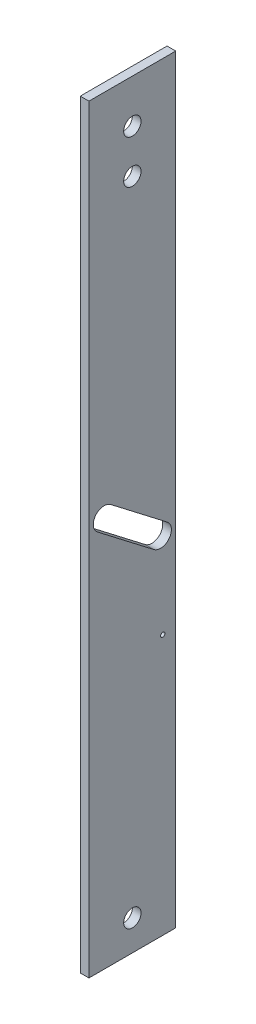
ISO-10303-21;
HEADER;
FILE_DESCRIPTION(('STEP AP214'),'2;1');
FILE_NAME('part.step','',(''),(''),'','','');
FILE_SCHEMA(('AUTOMOTIVE_DESIGN { 1 0 10303 214 1 1 1 1 }'));
ENDSEC;
DATA;
#1=APPLICATION_CONTEXT('core data for automotive mechanical design processes');
#2=APPLICATION_PROTOCOL_DEFINITION('international standard','automotive_design',2000,#1);
#3=PRODUCT_CONTEXT('',#1,'mechanical');
#4=PRODUCT('Part','Part','',(#3));
#5=PRODUCT_RELATED_PRODUCT_CATEGORY('part','',(#4));
#6=PRODUCT_DEFINITION_FORMATION('','',#4);
#7=PRODUCT_DEFINITION_CONTEXT('part definition',#1,'design');
#8=PRODUCT_DEFINITION('design','',#6,#7);
#9=PRODUCT_DEFINITION_SHAPE('','',#8);
#10=(LENGTH_UNIT() NAMED_UNIT(*) SI_UNIT(.MILLI.,.METRE.));
#11=(NAMED_UNIT(*) PLANE_ANGLE_UNIT() SI_UNIT($,.RADIAN.));
#12=(NAMED_UNIT(*) SI_UNIT($,.STERADIAN.) SOLID_ANGLE_UNIT());
#13=UNCERTAINTY_MEASURE_WITH_UNIT(LENGTH_MEASURE(1.E-05),#10,'distance_accuracy_value','');
#14=(GEOMETRIC_REPRESENTATION_CONTEXT(3) GLOBAL_UNCERTAINTY_ASSIGNED_CONTEXT((#13)) GLOBAL_UNIT_ASSIGNED_CONTEXT((#10,
#11,#12)) REPRESENTATION_CONTEXT('',''));
#15=CARTESIAN_POINT('',(0.,0.,0.));
#16=DIRECTION('',(0.,0.,1.));
#17=DIRECTION('',(1.,0.,0.));
#18=AXIS2_PLACEMENT_3D('',#15,#16,#17);
#19=CARTESIAN_POINT('',(2.,0.,0.));
#20=DIRECTION('',(0.,0.,-1.));
#21=DIRECTION('',(-1.,0.,0.));
#22=AXIS2_PLACEMENT_3D('',#19,#20,#21);
#23=PLANE('',#22);
#24=DIRECTION('',(0.,-1.,0.));
#25=VECTOR('',#24,1.);
#26=CARTESIAN_POINT('',(0.,0.,0.));
#27=LINE('',#26,#25);
#28=CARTESIAN_POINT('',(0.,175.,0.));
#29=VERTEX_POINT('',#28);
#30=CARTESIAN_POINT('',(0.,0.,0.));
#31=VERTEX_POINT('',#30);
#32=EDGE_CURVE('E144',#29,#31,#27,.T.);
#33=ORIENTED_EDGE('',*,*,#32,.T.);
#34=DIRECTION('',(-1.,0.,0.));
#35=VECTOR('',#34,1.);
#36=CARTESIAN_POINT('',(2.,0.,0.));
#37=LINE('',#36,#35);
#38=CARTESIAN_POINT('',(2.,0.,0.));
#39=VERTEX_POINT('',#38);
#40=EDGE_CURVE('E11',#39,#31,#37,.T.);
#41=ORIENTED_EDGE('',*,*,#40,.F.);
#42=DIRECTION('',(0.,-1.,0.));
#43=VECTOR('',#42,1.);
#44=CARTESIAN_POINT('',(2.,0.,0.));
#45=LINE('',#44,#43);
#46=CARTESIAN_POINT('',(2.,175.,0.));
#47=VERTEX_POINT('',#46);
#48=EDGE_CURVE('E149',#47,#39,#45,.T.);
#49=ORIENTED_EDGE('',*,*,#48,.F.);
#50=DIRECTION('',(-1.,0.,0.));
#51=VECTOR('',#50,1.);
#52=CARTESIAN_POINT('',(2.,175.,0.));
#53=LINE('',#52,#51);
#54=EDGE_CURVE('E159',#47,#29,#53,.T.);
#55=ORIENTED_EDGE('',*,*,#54,.T.);
#56=EDGE_LOOP('',(#33,#41,#49,#55));
#57=FACE_BOUND('',#56,.T.);
#58=ADVANCED_FACE('F32',(#57),#23,.F.);
#59=CARTESIAN_POINT('',(2.,0.,0.));
#60=DIRECTION('',(0.,1.,0.));
#61=DIRECTION('',(0.,0.,1.));
#62=AXIS2_PLACEMENT_3D('',#59,#60,#61);
#63=PLANE('',#62);
#64=DIRECTION('',(0.,0.,-1.));
#65=VECTOR('',#64,1.);
#66=CARTESIAN_POINT('',(0.,0.,0.));
#67=LINE('',#66,#65);
#68=CARTESIAN_POINT('',(0.,0.,-20.));
#69=VERTEX_POINT('',#68);
#70=EDGE_CURVE('E162',#31,#69,#67,.T.);
#71=ORIENTED_EDGE('',*,*,#70,.T.);
#72=DIRECTION('',(-1.,0.,0.));
#73=VECTOR('',#72,1.);
#74=CARTESIAN_POINT('',(2.,0.,-20.));
#75=LINE('',#74,#73);
#76=CARTESIAN_POINT('',(2.,0.,-20.));
#77=VERTEX_POINT('',#76);
#78=EDGE_CURVE('E39',#77,#69,#75,.T.);
#79=ORIENTED_EDGE('',*,*,#78,.F.);
#80=DIRECTION('',(0.,0.,-1.));
#81=VECTOR('',#80,1.);
#82=CARTESIAN_POINT('',(2.,0.,0.));
#83=LINE('',#82,#81);
#84=EDGE_CURVE('E152',#39,#77,#83,.T.);
#85=ORIENTED_EDGE('',*,*,#84,.F.);
#86=ORIENTED_EDGE('',*,*,#40,.T.);
#87=EDGE_LOOP('',(#71,#79,#85,#86));
#88=FACE_BOUND('',#87,.T.);
#89=ADVANCED_FACE('F191',(#88),#63,.F.);
#90=CARTESIAN_POINT('',(2.,0.,-20.));
#91=DIRECTION('',(0.,0.,1.));
#92=DIRECTION('',(1.,0.,0.));
#93=AXIS2_PLACEMENT_3D('',#90,#91,#92);
#94=PLANE('',#93);
#95=DIRECTION('',(0.,1.,0.));
#96=VECTOR('',#95,1.);
#97=CARTESIAN_POINT('',(0.,0.,-20.));
#98=LINE('',#97,#96);
#99=CARTESIAN_POINT('',(0.,175.,-20.));
#100=VERTEX_POINT('',#99);
#101=EDGE_CURVE('E164',#69,#100,#98,.T.);
#102=ORIENTED_EDGE('',*,*,#101,.T.);
#103=DIRECTION('',(-1.,0.,0.));
#104=VECTOR('',#103,1.);
#105=CARTESIAN_POINT('',(2.,175.,-20.));
#106=LINE('',#105,#104);
#107=CARTESIAN_POINT('',(2.,175.,-20.));
#108=VERTEX_POINT('',#107);
#109=EDGE_CURVE('E169',#108,#100,#106,.T.);
#110=ORIENTED_EDGE('',*,*,#109,.F.);
#111=DIRECTION('',(0.,1.,0.));
#112=VECTOR('',#111,1.);
#113=CARTESIAN_POINT('',(2.,0.,-20.));
#114=LINE('',#113,#112);
#115=EDGE_CURVE('E155',#77,#108,#114,.T.);
#116=ORIENTED_EDGE('',*,*,#115,.F.);
#117=ORIENTED_EDGE('',*,*,#78,.T.);
#118=EDGE_LOOP('',(#102,#110,#116,#117));
#119=FACE_BOUND('',#118,.T.);
#120=ADVANCED_FACE('F176',(#119),#94,.F.);
#121=CARTESIAN_POINT('',(2.,175.,0.));
#122=DIRECTION('',(0.,-1.,0.));
#123=DIRECTION('',(0.,0.,-1.));
#124=AXIS2_PLACEMENT_3D('',#121,#122,#123);
#125=PLANE('',#124);
#126=DIRECTION('',(0.,0.,1.));
#127=VECTOR('',#126,1.);
#128=CARTESIAN_POINT('',(0.,175.,0.));
#129=LINE('',#128,#127);
#130=EDGE_CURVE('E153',#100,#29,#129,.T.);
#131=ORIENTED_EDGE('',*,*,#130,.T.);
#132=ORIENTED_EDGE('',*,*,#54,.F.);
#133=DIRECTION('',(0.,0.,1.));
#134=VECTOR('',#133,1.);
#135=CARTESIAN_POINT('',(2.,175.,0.));
#136=LINE('',#135,#134);
#137=EDGE_CURVE('E157',#108,#47,#136,.T.);
#138=ORIENTED_EDGE('',*,*,#137,.F.);
#139=ORIENTED_EDGE('',*,*,#109,.T.);
#140=EDGE_LOOP('',(#131,#132,#138,#139));
#141=FACE_BOUND('',#140,.T.);
#142=ADVANCED_FACE('F184',(#141),#125,.F.);
#143=CARTESIAN_POINT('',(2.,0.,0.));
#144=DIRECTION('',(-1.,0.,0.));
#145=DIRECTION('',(0.,0.,1.));
#146=AXIS2_PLACEMENT_3D('',#143,#144,#145);
#147=PLANE('',#146);
#148=CARTESIAN_POINT('',(2.,165.,-9.99999999999999));
#149=DIRECTION('',(1.,0.,0.));
#150=DIRECTION('',(0.,0.,-1.));
#151=AXIS2_PLACEMENT_3D('',#148,#149,#150);
#152=CIRCLE('',#151,2.);
#153=CARTESIAN_POINT('',(2.,165.,-12.));
#154=VERTEX_POINT('',#153);
#155=EDGE_CURVE('E240',#154,#154,#152,.T.);
#156=ORIENTED_EDGE('',*,*,#155,.F.);
#157=EDGE_LOOP('',(#156));
#158=FACE_BOUND('',#157,.T.);
#159=CARTESIAN_POINT('',(2.,155.,-9.99999999999999));
#160=DIRECTION('',(1.,0.,0.));
#161=DIRECTION('',(0.,0.,-1.));
#162=AXIS2_PLACEMENT_3D('',#159,#160,#161);
#163=CIRCLE('',#162,2.);
#164=CARTESIAN_POINT('',(2.,155.,-12.));
#165=VERTEX_POINT('',#164);
#166=EDGE_CURVE('E120',#165,#165,#163,.T.);
#167=ORIENTED_EDGE('',*,*,#166,.F.);
#168=EDGE_LOOP('',(#167));
#169=FACE_BOUND('',#168,.T.);
#170=DIRECTION('',(0.,0.609710760849692,0.792623989104601));
#171=VECTOR('',#170,1.);
#172=CARTESIAN_POINT('',(2.,81.9815599727615,-18.0242769021242));
#173=LINE('',#172,#171);
#174=CARTESIAN_POINT('',(2.,81.9815599727615,-18.0242769021242));
#175=VERTEX_POINT('',#174);
#176=CARTESIAN_POINT('',(2.,91.9815599727615,-5.02427690212424));
#177=VERTEX_POINT('',#176);
#178=EDGE_CURVE('E126',#175,#177,#173,.T.);
#179=ORIENTED_EDGE('',*,*,#178,.F.);
#180=CARTESIAN_POINT('',(2.,80.,-16.5));
#181=DIRECTION('',(1.,0.,0.));
#182=DIRECTION('',(0.,0.,-1.));
#183=AXIS2_PLACEMENT_3D('',#180,#181,#182);
#184=CIRCLE('',#183,2.50000000000002);
#185=CARTESIAN_POINT('',(2.,78.0184400272385,-14.9757230978757));
#186=VERTEX_POINT('',#185);
#187=EDGE_CURVE('E46',#186,#175,#184,.T.);
#188=ORIENTED_EDGE('',*,*,#187,.F.);
#189=DIRECTION('',(0.,-0.609710760849692,-0.7926239891046));
#190=VECTOR('',#189,1.);
#191=CARTESIAN_POINT('',(2.,78.0184400272385,-14.9757230978757));
#192=LINE('',#191,#190);
#193=CARTESIAN_POINT('',(2.,88.0184400272385,-1.97572309787576));
#194=VERTEX_POINT('',#193);
#195=EDGE_CURVE('E114',#194,#186,#192,.T.);
#196=ORIENTED_EDGE('',*,*,#195,.F.);
#197=CARTESIAN_POINT('',(2.,90.,-3.5));
#198=DIRECTION('',(1.,0.,0.));
#199=DIRECTION('',(0.,0.,-1.));
#200=AXIS2_PLACEMENT_3D('',#197,#198,#199);
#201=CIRCLE('',#200,2.50000000000001);
#202=EDGE_CURVE('E117',#177,#194,#201,.T.);
#203=ORIENTED_EDGE('',*,*,#202,.F.);
#204=EDGE_LOOP('',(#179,#188,#196,#203));
#205=FACE_BOUND('',#204,.T.);
#206=CARTESIAN_POINT('',(2.,60.,-17.));
#207=DIRECTION('',(1.,0.,0.));
#208=DIRECTION('',(0.,0.,-1.));
#209=AXIS2_PLACEMENT_3D('',#206,#207,#208);
#210=CIRCLE('',#209,0.499999999999999);
#211=CARTESIAN_POINT('',(2.,60.,-17.5));
#212=VERTEX_POINT('',#211);
#213=EDGE_CURVE('E138',#212,#212,#210,.T.);
#214=ORIENTED_EDGE('',*,*,#213,.F.);
#215=EDGE_LOOP('',(#214));
#216=FACE_BOUND('',#215,.T.);
#217=CARTESIAN_POINT('',(2.,7.,-9.99999999999999));
#218=DIRECTION('',(1.,0.,0.));
#219=DIRECTION('',(0.,0.,-1.));
#220=AXIS2_PLACEMENT_3D('',#217,#218,#219);
#221=CIRCLE('',#220,2.);
#222=CARTESIAN_POINT('',(2.,7.,-12.));
#223=VERTEX_POINT('',#222);
#224=EDGE_CURVE('E145',#223,#223,#221,.T.);
#225=ORIENTED_EDGE('',*,*,#224,.F.);
#226=EDGE_LOOP('',(#225));
#227=FACE_BOUND('',#226,.T.);
#228=ORIENTED_EDGE('',*,*,#48,.T.);
#229=ORIENTED_EDGE('',*,*,#84,.T.);
#230=ORIENTED_EDGE('',*,*,#115,.T.);
#231=ORIENTED_EDGE('',*,*,#137,.T.);
#232=EDGE_LOOP('',(#228,#229,#230,#231));
#233=FACE_BOUND('',#232,.T.);
#234=ADVANCED_FACE('F190',(#158,#169,#205,#216,#227,#233),#147,.F.);
#235=CARTESIAN_POINT('',(0.,0.,0.));
#236=DIRECTION('',(-1.,0.,0.));
#237=DIRECTION('',(0.,0.,1.));
#238=AXIS2_PLACEMENT_3D('',#235,#236,#237);
#239=PLANE('',#238);
#240=CARTESIAN_POINT('',(0.,165.,-9.99999999999999));
#241=DIRECTION('',(1.,0.,0.));
#242=DIRECTION('',(0.,0.,-1.));
#243=AXIS2_PLACEMENT_3D('',#240,#241,#242);
#244=CIRCLE('',#243,2.);
#245=CARTESIAN_POINT('',(0.,165.,-12.));
#246=VERTEX_POINT('',#245);
#247=EDGE_CURVE('E148',#246,#246,#244,.T.);
#248=ORIENTED_EDGE('',*,*,#247,.T.);
#249=EDGE_LOOP('',(#248));
#250=FACE_BOUND('',#249,.T.);
#251=CARTESIAN_POINT('',(0.,155.,-9.99999999999999));
#252=DIRECTION('',(1.,0.,0.));
#253=DIRECTION('',(0.,0.,-1.));
#254=AXIS2_PLACEMENT_3D('',#251,#252,#253);
#255=CIRCLE('',#254,2.);
#256=CARTESIAN_POINT('',(0.,155.,-12.));
#257=VERTEX_POINT('',#256);
#258=EDGE_CURVE('E241',#257,#257,#255,.T.);
#259=ORIENTED_EDGE('',*,*,#258,.T.);
#260=EDGE_LOOP('',(#259));
#261=FACE_BOUND('',#260,.T.);
#262=CARTESIAN_POINT('',(0.,80.,-16.5));
#263=DIRECTION('',(1.,0.,0.));
#264=DIRECTION('',(0.,0.,-1.));
#265=AXIS2_PLACEMENT_3D('',#262,#263,#264);
#266=CIRCLE('',#265,2.50000000000002);
#267=CARTESIAN_POINT('',(0.,78.0184400272385,-14.9757230978757));
#268=VERTEX_POINT('',#267);
#269=CARTESIAN_POINT('',(0.,81.9815599727615,-18.0242769021242));
#270=VERTEX_POINT('',#269);
#271=EDGE_CURVE('E98',#268,#270,#266,.T.);
#272=ORIENTED_EDGE('',*,*,#271,.T.);
#273=DIRECTION('',(0.,0.609710760849692,0.792623989104601));
#274=VECTOR('',#273,1.);
#275=CARTESIAN_POINT('',(0.,81.9815599727615,-18.0242769021242));
#276=LINE('',#275,#274);
#277=CARTESIAN_POINT('',(0.,91.9815599727615,-5.02427690212424));
#278=VERTEX_POINT('',#277);
#279=EDGE_CURVE('E107',#270,#278,#276,.T.);
#280=ORIENTED_EDGE('',*,*,#279,.T.);
#281=CARTESIAN_POINT('',(0.,90.,-3.5));
#282=DIRECTION('',(1.,0.,0.));
#283=DIRECTION('',(0.,0.,-1.));
#284=AXIS2_PLACEMENT_3D('',#281,#282,#283);
#285=CIRCLE('',#284,2.50000000000001);
#286=CARTESIAN_POINT('',(0.,88.0184400272385,-1.97572309787576));
#287=VERTEX_POINT('',#286);
#288=EDGE_CURVE('E54',#278,#287,#285,.T.);
#289=ORIENTED_EDGE('',*,*,#288,.T.);
#290=DIRECTION('',(0.,-0.609710760849692,-0.7926239891046));
#291=VECTOR('',#290,1.);
#292=CARTESIAN_POINT('',(0.,78.0184400272385,-14.9757230978757));
#293=LINE('',#292,#291);
#294=EDGE_CURVE('E104',#287,#268,#293,.T.);
#295=ORIENTED_EDGE('',*,*,#294,.T.);
#296=EDGE_LOOP('',(#272,#280,#289,#295));
#297=FACE_BOUND('',#296,.T.);
#298=CARTESIAN_POINT('',(0.,60.,-17.));
#299=DIRECTION('',(1.,0.,0.));
#300=DIRECTION('',(0.,0.,-1.));
#301=AXIS2_PLACEMENT_3D('',#298,#299,#300);
#302=CIRCLE('',#301,0.499999999999999);
#303=CARTESIAN_POINT('',(0.,60.,-17.5));
#304=VERTEX_POINT('',#303);
#305=EDGE_CURVE('E127',#304,#304,#302,.T.);
#306=ORIENTED_EDGE('',*,*,#305,.T.);
#307=EDGE_LOOP('',(#306));
#308=FACE_BOUND('',#307,.T.);
#309=CARTESIAN_POINT('',(0.,7.,-9.99999999999999));
#310=DIRECTION('',(1.,0.,0.));
#311=DIRECTION('',(0.,0.,-1.));
#312=AXIS2_PLACEMENT_3D('',#309,#310,#311);
#313=CIRCLE('',#312,2.);
#314=CARTESIAN_POINT('',(0.,7.,-12.));
#315=VERTEX_POINT('',#314);
#316=EDGE_CURVE('E141',#315,#315,#313,.T.);
#317=ORIENTED_EDGE('',*,*,#316,.T.);
#318=EDGE_LOOP('',(#317));
#319=FACE_BOUND('',#318,.T.);
#320=ORIENTED_EDGE('',*,*,#32,.F.);
#321=ORIENTED_EDGE('',*,*,#130,.F.);
#322=ORIENTED_EDGE('',*,*,#101,.F.);
#323=ORIENTED_EDGE('',*,*,#70,.F.);
#324=EDGE_LOOP('',(#320,#321,#322,#323));
#325=FACE_BOUND('',#324,.T.);
#326=ADVANCED_FACE('F111',(#250,#261,#297,#308,#319,#325),#239,.T.);
#327=CARTESIAN_POINT('',(0.,7.,-9.99999999999999));
#328=DIRECTION('',(1.,0.,0.));
#329=DIRECTION('',(0.,0.,-1.));
#330=AXIS2_PLACEMENT_3D('',#327,#328,#329);
#331=CYLINDRICAL_SURFACE('',#330,2.);
#332=ORIENTED_EDGE('',*,*,#316,.F.);
#333=EDGE_LOOP('',(#332));
#334=FACE_BOUND('',#333,.T.);
#335=ORIENTED_EDGE('',*,*,#224,.T.);
#336=EDGE_LOOP('',(#335));
#337=FACE_BOUND('',#336,.T.);
#338=ADVANCED_FACE('F203',(#334,#337),#331,.F.);
#339=CARTESIAN_POINT('',(0.,60.,-17.));
#340=DIRECTION('',(1.,0.,0.));
#341=DIRECTION('',(0.,0.,-1.));
#342=AXIS2_PLACEMENT_3D('',#339,#340,#341);
#343=CYLINDRICAL_SURFACE('',#342,0.499999999999999);
#344=ORIENTED_EDGE('',*,*,#305,.F.);
#345=EDGE_LOOP('',(#344));
#346=FACE_BOUND('',#345,.T.);
#347=ORIENTED_EDGE('',*,*,#213,.T.);
#348=EDGE_LOOP('',(#347));
#349=FACE_BOUND('',#348,.T.);
#350=ADVANCED_FACE('F210',(#346,#349),#343,.F.);
#351=CARTESIAN_POINT('',(0.,80.,-16.5));
#352=DIRECTION('',(1.,0.,0.));
#353=DIRECTION('',(0.,0.,-1.));
#354=AXIS2_PLACEMENT_3D('',#351,#352,#353);
#355=CYLINDRICAL_SURFACE('',#354,2.50000000000002);
#356=ORIENTED_EDGE('',*,*,#187,.T.);
#357=DIRECTION('',(1.,0.,0.));
#358=VECTOR('',#357,1.);
#359=CARTESIAN_POINT('',(0.,81.9815599727615,-18.0242769021242));
#360=LINE('',#359,#358);
#361=EDGE_CURVE('E94',#270,#175,#360,.T.);
#362=ORIENTED_EDGE('',*,*,#361,.F.);
#363=ORIENTED_EDGE('',*,*,#271,.F.);
#364=DIRECTION('',(1.,0.,0.));
#365=VECTOR('',#364,1.);
#366=CARTESIAN_POINT('',(0.,78.0184400272385,-14.9757230978757));
#367=LINE('',#366,#365);
#368=EDGE_CURVE('E131',#268,#186,#367,.T.);
#369=ORIENTED_EDGE('',*,*,#368,.T.);
#370=EDGE_LOOP('',(#356,#362,#363,#369));
#371=FACE_BOUND('',#370,.T.);
#372=ADVANCED_FACE('F96',(#371),#355,.F.);
#373=CARTESIAN_POINT('',(0.,78.0184400272385,-14.9757230978757));
#374=DIRECTION('',(0.,-0.7926239891046,0.609710760849692));
#375=DIRECTION('',(0.,-0.609710760849692,-0.7926239891046));
#376=AXIS2_PLACEMENT_3D('',#373,#374,#375);
#377=PLANE('',#376);
#378=ORIENTED_EDGE('',*,*,#195,.T.);
#379=ORIENTED_EDGE('',*,*,#368,.F.);
#380=ORIENTED_EDGE('',*,*,#294,.F.);
#381=DIRECTION('',(1.,0.,0.));
#382=VECTOR('',#381,1.);
#383=CARTESIAN_POINT('',(0.,88.0184400272385,-1.97572309787576));
#384=LINE('',#383,#382);
#385=EDGE_CURVE('E133',#287,#194,#384,.T.);
#386=ORIENTED_EDGE('',*,*,#385,.T.);
#387=EDGE_LOOP('',(#378,#379,#380,#386));
#388=FACE_BOUND('',#387,.T.);
#389=ADVANCED_FACE('F217',(#388),#377,.F.);
#390=CARTESIAN_POINT('',(0.,90.,-3.5));
#391=DIRECTION('',(1.,0.,0.));
#392=DIRECTION('',(0.,0.,-1.));
#393=AXIS2_PLACEMENT_3D('',#390,#391,#392);
#394=CYLINDRICAL_SURFACE('',#393,2.50000000000001);
#395=ORIENTED_EDGE('',*,*,#202,.T.);
#396=ORIENTED_EDGE('',*,*,#385,.F.);
#397=ORIENTED_EDGE('',*,*,#288,.F.);
#398=DIRECTION('',(1.,0.,0.));
#399=VECTOR('',#398,1.);
#400=CARTESIAN_POINT('',(0.,91.9815599727615,-5.02427690212424));
#401=LINE('',#400,#399);
#402=EDGE_CURVE('E103',#278,#177,#401,.T.);
#403=ORIENTED_EDGE('',*,*,#402,.T.);
#404=EDGE_LOOP('',(#395,#396,#397,#403));
#405=FACE_BOUND('',#404,.T.);
#406=ADVANCED_FACE('F221',(#405),#394,.F.);
#407=CARTESIAN_POINT('',(0.,81.9815599727615,-18.0242769021242));
#408=DIRECTION('',(0.,0.792623989104601,-0.609710760849692));
#409=DIRECTION('',(0.,0.609710760849692,0.792623989104601));
#410=AXIS2_PLACEMENT_3D('',#407,#408,#409);
#411=PLANE('',#410);
#412=ORIENTED_EDGE('',*,*,#178,.T.);
#413=ORIENTED_EDGE('',*,*,#402,.F.);
#414=ORIENTED_EDGE('',*,*,#279,.F.);
#415=ORIENTED_EDGE('',*,*,#361,.T.);
#416=EDGE_LOOP('',(#412,#413,#414,#415));
#417=FACE_BOUND('',#416,.T.);
#418=ADVANCED_FACE('F108',(#417),#411,.F.);
#419=CARTESIAN_POINT('',(0.,155.,-9.99999999999999));
#420=DIRECTION('',(1.,0.,0.));
#421=DIRECTION('',(0.,0.,-1.));
#422=AXIS2_PLACEMENT_3D('',#419,#420,#421);
#423=CYLINDRICAL_SURFACE('',#422,2.);
#424=ORIENTED_EDGE('',*,*,#258,.F.);
#425=EDGE_LOOP('',(#424));
#426=FACE_BOUND('',#425,.T.);
#427=ORIENTED_EDGE('',*,*,#166,.T.);
#428=EDGE_LOOP('',(#427));
#429=FACE_BOUND('',#428,.T.);
#430=ADVANCED_FACE('F220',(#426,#429),#423,.F.);
#431=CARTESIAN_POINT('',(0.,165.,-9.99999999999999));
#432=DIRECTION('',(1.,0.,0.));
#433=DIRECTION('',(0.,0.,-1.));
#434=AXIS2_PLACEMENT_3D('',#431,#432,#433);
#435=CYLINDRICAL_SURFACE('',#434,2.);
#436=ORIENTED_EDGE('',*,*,#247,.F.);
#437=EDGE_LOOP('',(#436));
#438=FACE_BOUND('',#437,.T.);
#439=ORIENTED_EDGE('',*,*,#155,.T.);
#440=EDGE_LOOP('',(#439));
#441=FACE_BOUND('',#440,.T.);
#442=ADVANCED_FACE('F229',(#438,#441),#435,.F.);
#443=CLOSED_SHELL('',(#58,#89,#120,#142,#234,#326,#338,#350,#372,#389,#406,#418,#430,#442));
#444=MANIFOLD_SOLID_BREP('B2',#443);
#445=ADVANCED_BREP_SHAPE_REPRESENTATION('',(#18,#444),#14);
#446=SHAPE_DEFINITION_REPRESENTATION(#9,#445);
ENDSEC;
END-ISO-10303-21;
